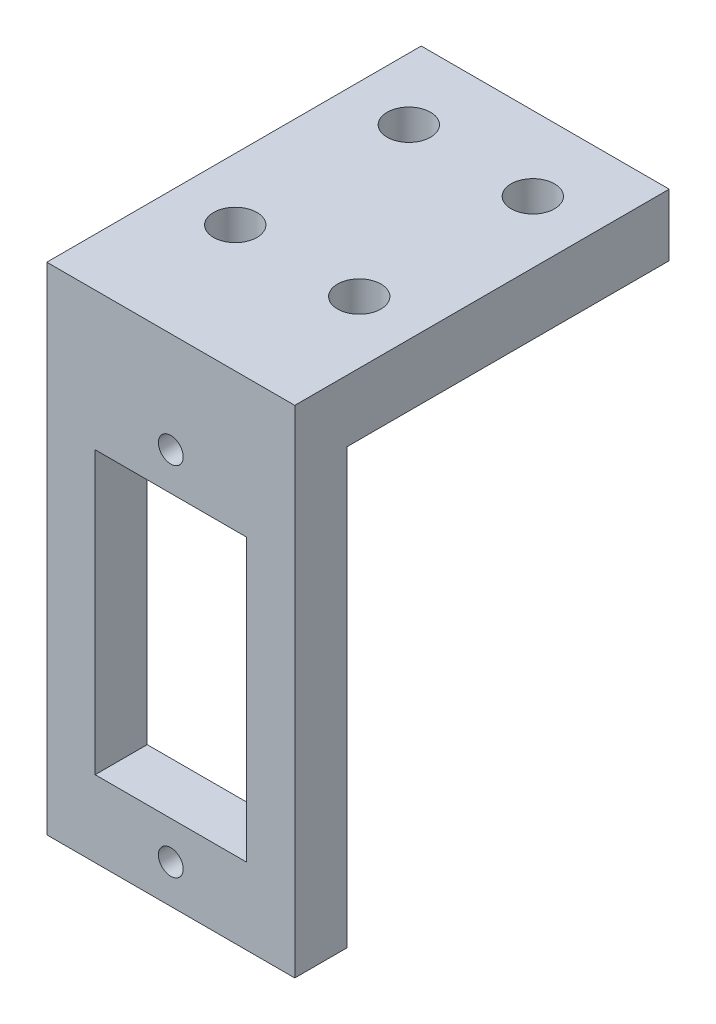
ISO-10303-21;
HEADER;
FILE_DESCRIPTION(('STEP AP214'),'2;1');
FILE_NAME('part.step','',(''),(''),'','','');
FILE_SCHEMA(('AUTOMOTIVE_DESIGN { 1 0 10303 214 1 1 1 1 }'));
ENDSEC;
DATA;
#1=APPLICATION_CONTEXT('core data for automotive mechanical design processes');
#2=APPLICATION_PROTOCOL_DEFINITION('international standard','automotive_design',2000,#1);
#3=PRODUCT_CONTEXT('',#1,'mechanical');
#4=PRODUCT('Part','Part','',(#3));
#5=PRODUCT_RELATED_PRODUCT_CATEGORY('part','',(#4));
#6=PRODUCT_DEFINITION_FORMATION('','',#4);
#7=PRODUCT_DEFINITION_CONTEXT('part definition',#1,'design');
#8=PRODUCT_DEFINITION('design','',#6,#7);
#9=PRODUCT_DEFINITION_SHAPE('','',#8);
#10=(LENGTH_UNIT() NAMED_UNIT(*) SI_UNIT(.MILLI.,.METRE.));
#11=(NAMED_UNIT(*) PLANE_ANGLE_UNIT() SI_UNIT($,.RADIAN.));
#12=(NAMED_UNIT(*) SI_UNIT($,.STERADIAN.) SOLID_ANGLE_UNIT());
#13=UNCERTAINTY_MEASURE_WITH_UNIT(LENGTH_MEASURE(1.E-05),#10,'distance_accuracy_value','');
#14=(GEOMETRIC_REPRESENTATION_CONTEXT(3) GLOBAL_UNCERTAINTY_ASSIGNED_CONTEXT((#13)) GLOBAL_UNIT_ASSIGNED_CONTEXT((#10,
#11,#12)) REPRESENTATION_CONTEXT('',''));
#15=CARTESIAN_POINT('',(0.,0.,0.));
#16=DIRECTION('',(0.,0.,1.));
#17=DIRECTION('',(1.,0.,0.));
#18=AXIS2_PLACEMENT_3D('',#15,#16,#17);
#19=CARTESIAN_POINT('',(0.,0.,0.));
#20=DIRECTION('',(0.,0.,1.));
#21=DIRECTION('',(1.,0.,0.));
#22=AXIS2_PLACEMENT_3D('',#19,#20,#21);
#23=PLANE('',#22);
#24=DIRECTION('',(1.,0.,0.));
#25=VECTOR('',#24,1.);
#26=CARTESIAN_POINT('',(6.1,11.35,0.));
#27=LINE('',#26,#25);
#28=CARTESIAN_POINT('',(-6.1,11.35,0.));
#29=VERTEX_POINT('',#28);
#30=CARTESIAN_POINT('',(6.1,11.35,0.));
#31=VERTEX_POINT('',#30);
#32=EDGE_CURVE('E213',#29,#31,#27,.T.);
#33=ORIENTED_EDGE('',*,*,#32,.F.);
#34=DIRECTION('',(0.,1.,0.));
#35=VECTOR('',#34,1.);
#36=CARTESIAN_POINT('',(-6.1,11.35,0.));
#37=LINE('',#36,#35);
#38=CARTESIAN_POINT('',(-6.1,-11.35,0.));
#39=VERTEX_POINT('',#38);
#40=EDGE_CURVE('E164',#39,#29,#37,.T.);
#41=ORIENTED_EDGE('',*,*,#40,.F.);
#42=DIRECTION('',(-1.,0.,0.));
#43=VECTOR('',#42,1.);
#44=CARTESIAN_POINT('',(6.1,-11.35,0.));
#45=LINE('',#44,#43);
#46=CARTESIAN_POINT('',(6.1,-11.35,0.));
#47=VERTEX_POINT('',#46);
#48=EDGE_CURVE('E221',#47,#39,#45,.T.);
#49=ORIENTED_EDGE('',*,*,#48,.F.);
#50=DIRECTION('',(0.,-1.,0.));
#51=VECTOR('',#50,1.);
#52=CARTESIAN_POINT('',(6.1,11.35,0.));
#53=LINE('',#52,#51);
#54=EDGE_CURVE('E217',#31,#47,#53,.T.);
#55=ORIENTED_EDGE('',*,*,#54,.F.);
#56=EDGE_LOOP('',(#33,#41,#49,#55));
#57=FACE_BOUND('',#56,.T.);
#58=CARTESIAN_POINT('',(0.,-14.3963608791062,0.));
#59=DIRECTION('',(0.,0.,1.));
#60=DIRECTION('',(1.,0.,0.));
#61=AXIS2_PLACEMENT_3D('',#58,#59,#60);
#62=CIRCLE('',#61,1.00133746946598);
#63=CARTESIAN_POINT('',(1.00133746946598,-14.3963608791062,0.));
#64=VERTEX_POINT('',#63);
#65=EDGE_CURVE('E155',#64,#64,#62,.T.);
#66=ORIENTED_EDGE('',*,*,#65,.T.);
#67=EDGE_LOOP('',(#66));
#68=FACE_BOUND('',#67,.T.);
#69=CARTESIAN_POINT('',(0.,14.4,0.));
#70=DIRECTION('',(0.,0.,1.));
#71=DIRECTION('',(1.,0.,0.));
#72=AXIS2_PLACEMENT_3D('',#69,#70,#71);
#73=CIRCLE('',#72,1.);
#74=CARTESIAN_POINT('',(1.,14.4,0.));
#75=VERTEX_POINT('',#74);
#76=EDGE_CURVE('E159',#75,#75,#73,.T.);
#77=ORIENTED_EDGE('',*,*,#76,.T.);
#78=EDGE_LOOP('',(#77));
#79=FACE_BOUND('',#78,.T.);
#80=DIRECTION('',(0.,1.,0.));
#81=VECTOR('',#80,1.);
#82=CARTESIAN_POINT('',(10.,22.5,0.));
#83=LINE('',#82,#81);
#84=CARTESIAN_POINT('',(10.,-17.5,0.));
#85=VERTEX_POINT('',#84);
#86=CARTESIAN_POINT('',(10.,17.5,0.));
#87=VERTEX_POINT('',#86);
#88=EDGE_CURVE('E64',#85,#87,#83,.T.);
#89=ORIENTED_EDGE('',*,*,#88,.F.);
#90=DIRECTION('',(-1.,0.,0.));
#91=VECTOR('',#90,1.);
#92=CARTESIAN_POINT('',(0.,-17.5,0.));
#93=LINE('',#92,#91);
#94=CARTESIAN_POINT('',(-10.,-17.5,0.));
#95=VERTEX_POINT('',#94);
#96=EDGE_CURVE('E134',#85,#95,#93,.T.);
#97=ORIENTED_EDGE('',*,*,#96,.T.);
#98=DIRECTION('',(0.,-1.,0.));
#99=VECTOR('',#98,1.);
#100=CARTESIAN_POINT('',(-10.,22.5,0.));
#101=LINE('',#100,#99);
#102=CARTESIAN_POINT('',(-10.,17.5,0.));
#103=VERTEX_POINT('',#102);
#104=EDGE_CURVE('E132',#103,#95,#101,.T.);
#105=ORIENTED_EDGE('',*,*,#104,.F.);
#106=DIRECTION('',(-1.,0.,0.));
#107=VECTOR('',#106,1.);
#108=CARTESIAN_POINT('',(10.,17.5,0.));
#109=LINE('',#108,#107);
#110=EDGE_CURVE('E180',#87,#103,#109,.T.);
#111=ORIENTED_EDGE('',*,*,#110,.F.);
#112=EDGE_LOOP('',(#89,#97,#105,#111));
#113=FACE_BOUND('',#112,.T.);
#114=ADVANCED_FACE('F39',(#57,#68,#79,#113),#23,.F.);
#115=CARTESIAN_POINT('',(10.,22.5,4.2));
#116=DIRECTION('',(-1.,0.,0.));
#117=DIRECTION('',(0.,-1.,0.));
#118=AXIS2_PLACEMENT_3D('',#115,#116,#117);
#119=PLANE('',#118);
#120=DIRECTION('',(0.,1.,0.));
#121=VECTOR('',#120,1.);
#122=CARTESIAN_POINT('',(10.,22.5,4.2));
#123=LINE('',#122,#121);
#124=CARTESIAN_POINT('',(10.,-17.5,4.2));
#125=VERTEX_POINT('',#124);
#126=CARTESIAN_POINT('',(10.,22.5,4.2));
#127=VERTEX_POINT('',#126);
#128=EDGE_CURVE('E146',#125,#127,#123,.T.);
#129=ORIENTED_EDGE('',*,*,#128,.F.);
#130=DIRECTION('',(0.,0.,1.));
#131=VECTOR('',#130,1.);
#132=CARTESIAN_POINT('',(10.,-17.5,-10.8));
#133=LINE('',#132,#131);
#134=EDGE_CURVE('E57',#85,#125,#133,.T.);
#135=ORIENTED_EDGE('',*,*,#134,.F.);
#136=ORIENTED_EDGE('',*,*,#88,.T.);
#137=DIRECTION('',(0.,0.,1.));
#138=VECTOR('',#137,1.);
#139=CARTESIAN_POINT('',(10.,17.5,-26.));
#140=LINE('',#139,#138);
#141=CARTESIAN_POINT('',(10.,17.5,-26.));
#142=VERTEX_POINT('',#141);
#143=EDGE_CURVE('E201',#142,#87,#140,.T.);
#144=ORIENTED_EDGE('',*,*,#143,.F.);
#145=DIRECTION('',(0.,-1.,0.));
#146=VECTOR('',#145,1.);
#147=CARTESIAN_POINT('',(10.,22.5,-26.));
#148=LINE('',#147,#146);
#149=CARTESIAN_POINT('',(10.,22.5,-26.));
#150=VERTEX_POINT('',#149);
#151=EDGE_CURVE('E185',#150,#142,#148,.T.);
#152=ORIENTED_EDGE('',*,*,#151,.F.);
#153=DIRECTION('',(0.,0.,-1.));
#154=VECTOR('',#153,1.);
#155=CARTESIAN_POINT('',(10.,22.5,4.2));
#156=LINE('',#155,#154);
#157=EDGE_CURVE('E11',#127,#150,#156,.T.);
#158=ORIENTED_EDGE('',*,*,#157,.F.);
#159=EDGE_LOOP('',(#129,#135,#136,#144,#152,#158));
#160=FACE_BOUND('',#159,.T.);
#161=ADVANCED_FACE('F41',(#160),#119,.F.);
#162=CARTESIAN_POINT('',(-10.,22.5,4.2));
#163=DIRECTION('',(0.,-1.,0.));
#164=DIRECTION('',(0.,0.,-1.));
#165=AXIS2_PLACEMENT_3D('',#162,#163,#164);
#166=PLANE('',#165);
#167=CARTESIAN_POINT('',(-5.,22.5,-20.));
#168=DIRECTION('',(0.,1.,0.));
#169=DIRECTION('',(0.,0.,-1.));
#170=AXIS2_PLACEMENT_3D('',#167,#168,#169);
#171=CIRCLE('',#170,1.75);
#172=CARTESIAN_POINT('',(-5.,22.5,-21.75));
#173=VERTEX_POINT('',#172);
#174=EDGE_CURVE('E270',#173,#173,#171,.T.);
#175=ORIENTED_EDGE('',*,*,#174,.F.);
#176=EDGE_LOOP('',(#175));
#177=FACE_BOUND('',#176,.T.);
#178=CARTESIAN_POINT('',(5.,22.5,-20.));
#179=DIRECTION('',(0.,1.,0.));
#180=DIRECTION('',(0.,0.,-1.));
#181=AXIS2_PLACEMENT_3D('',#178,#179,#180);
#182=CIRCLE('',#181,1.75);
#183=CARTESIAN_POINT('',(5.,22.5,-21.75));
#184=VERTEX_POINT('',#183);
#185=EDGE_CURVE('E274',#184,#184,#182,.T.);
#186=ORIENTED_EDGE('',*,*,#185,.F.);
#187=EDGE_LOOP('',(#186));
#188=FACE_BOUND('',#187,.T.);
#189=CARTESIAN_POINT('',(5.,22.5,-6.));
#190=DIRECTION('',(0.,1.,0.));
#191=DIRECTION('',(0.,0.,1.));
#192=AXIS2_PLACEMENT_3D('',#189,#190,#191);
#193=CIRCLE('',#192,1.75);
#194=CARTESIAN_POINT('',(5.,22.5,-4.25));
#195=VERTEX_POINT('',#194);
#196=EDGE_CURVE('E269',#195,#195,#193,.T.);
#197=ORIENTED_EDGE('',*,*,#196,.F.);
#198=EDGE_LOOP('',(#197));
#199=FACE_BOUND('',#198,.T.);
#200=CARTESIAN_POINT('',(-5.,22.5,-6.));
#201=DIRECTION('',(0.,1.,0.));
#202=DIRECTION('',(0.,0.,1.));
#203=AXIS2_PLACEMENT_3D('',#200,#201,#202);
#204=CIRCLE('',#203,1.75);
#205=CARTESIAN_POINT('',(-5.,22.5,-4.25));
#206=VERTEX_POINT('',#205);
#207=EDGE_CURVE('E170',#206,#206,#204,.T.);
#208=ORIENTED_EDGE('',*,*,#207,.F.);
#209=EDGE_LOOP('',(#208));
#210=FACE_BOUND('',#209,.T.);
#211=ORIENTED_EDGE('',*,*,#157,.T.);
#212=DIRECTION('',(1.,0.,0.));
#213=VECTOR('',#212,1.);
#214=CARTESIAN_POINT('',(10.,22.5,-26.));
#215=LINE('',#214,#213);
#216=CARTESIAN_POINT('',(-10.,22.5,-26.));
#217=VERTEX_POINT('',#216);
#218=EDGE_CURVE('E196',#217,#150,#215,.T.);
#219=ORIENTED_EDGE('',*,*,#218,.F.);
#220=DIRECTION('',(0.,0.,-1.));
#221=VECTOR('',#220,1.);
#222=CARTESIAN_POINT('',(-10.,22.5,4.2));
#223=LINE('',#222,#221);
#224=CARTESIAN_POINT('',(-10.,22.5,4.2));
#225=VERTEX_POINT('',#224);
#226=EDGE_CURVE('E49',#225,#217,#223,.T.);
#227=ORIENTED_EDGE('',*,*,#226,.F.);
#228=DIRECTION('',(-1.,0.,0.));
#229=VECTOR('',#228,1.);
#230=CARTESIAN_POINT('',(-10.,22.5,4.2));
#231=LINE('',#230,#229);
#232=EDGE_CURVE('E139',#127,#225,#231,.T.);
#233=ORIENTED_EDGE('',*,*,#232,.F.);
#234=EDGE_LOOP('',(#211,#219,#227,#233));
#235=FACE_BOUND('',#234,.T.);
#236=ADVANCED_FACE('F252',(#177,#188,#199,#210,#235),#166,.F.);
#237=CARTESIAN_POINT('',(-10.,22.5,4.2));
#238=DIRECTION('',(1.,0.,0.));
#239=DIRECTION('',(0.,1.,0.));
#240=AXIS2_PLACEMENT_3D('',#237,#238,#239);
#241=PLANE('',#240);
#242=ORIENTED_EDGE('',*,*,#104,.T.);
#243=DIRECTION('',(0.,0.,1.));
#244=VECTOR('',#243,1.);
#245=CARTESIAN_POINT('',(-10.,-17.5,-10.8));
#246=LINE('',#245,#244);
#247=CARTESIAN_POINT('',(-10.,-17.5,4.2));
#248=VERTEX_POINT('',#247);
#249=EDGE_CURVE('E119',#95,#248,#246,.T.);
#250=ORIENTED_EDGE('',*,*,#249,.T.);
#251=DIRECTION('',(0.,-1.,0.));
#252=VECTOR('',#251,1.);
#253=CARTESIAN_POINT('',(-10.,22.5,4.2));
#254=LINE('',#253,#252);
#255=EDGE_CURVE('E130',#225,#248,#254,.T.);
#256=ORIENTED_EDGE('',*,*,#255,.F.);
#257=ORIENTED_EDGE('',*,*,#226,.T.);
#258=DIRECTION('',(0.,1.,0.));
#259=VECTOR('',#258,1.);
#260=CARTESIAN_POINT('',(-10.,22.5,-26.));
#261=LINE('',#260,#259);
#262=CARTESIAN_POINT('',(-10.,17.5,-26.));
#263=VERTEX_POINT('',#262);
#264=EDGE_CURVE('E260',#263,#217,#261,.T.);
#265=ORIENTED_EDGE('',*,*,#264,.F.);
#266=DIRECTION('',(0.,0.,1.));
#267=VECTOR('',#266,1.);
#268=CARTESIAN_POINT('',(-10.,17.5,-26.));
#269=LINE('',#268,#267);
#270=EDGE_CURVE('E198',#263,#103,#269,.T.);
#271=ORIENTED_EDGE('',*,*,#270,.T.);
#272=EDGE_LOOP('',(#242,#250,#256,#257,#265,#271));
#273=FACE_BOUND('',#272,.T.);
#274=ADVANCED_FACE('F129',(#273),#241,.F.);
#275=CARTESIAN_POINT('',(0.,0.,4.2));
#276=DIRECTION('',(0.,0.,1.));
#277=DIRECTION('',(1.,0.,0.));
#278=AXIS2_PLACEMENT_3D('',#275,#276,#277);
#279=PLANE('',#278);
#280=DIRECTION('',(-1.,0.,0.));
#281=VECTOR('',#280,1.);
#282=CARTESIAN_POINT('',(-10.,-17.5,4.2));
#283=LINE('',#282,#281);
#284=EDGE_CURVE('E116',#125,#248,#283,.T.);
#285=ORIENTED_EDGE('',*,*,#284,.F.);
#286=ORIENTED_EDGE('',*,*,#128,.T.);
#287=ORIENTED_EDGE('',*,*,#232,.T.);
#288=ORIENTED_EDGE('',*,*,#255,.T.);
#289=EDGE_LOOP('',(#285,#286,#287,#288));
#290=FACE_BOUND('',#289,.T.);
#291=CARTESIAN_POINT('',(0.,14.4,4.2));
#292=DIRECTION('',(0.,0.,1.));
#293=DIRECTION('',(1.,0.,0.));
#294=AXIS2_PLACEMENT_3D('',#291,#292,#293);
#295=CIRCLE('',#294,1.);
#296=CARTESIAN_POINT('',(1.,14.4,4.2));
#297=VERTEX_POINT('',#296);
#298=EDGE_CURVE('E160',#297,#297,#295,.T.);
#299=ORIENTED_EDGE('',*,*,#298,.F.);
#300=EDGE_LOOP('',(#299));
#301=FACE_BOUND('',#300,.T.);
#302=CARTESIAN_POINT('',(0.,-14.3963608791062,4.2));
#303=DIRECTION('',(0.,0.,1.));
#304=DIRECTION('',(1.,0.,0.));
#305=AXIS2_PLACEMENT_3D('',#302,#303,#304);
#306=CIRCLE('',#305,1.00133746946598);
#307=CARTESIAN_POINT('',(1.00133746946598,-14.3963608791062,4.2));
#308=VERTEX_POINT('',#307);
#309=EDGE_CURVE('E204',#308,#308,#306,.T.);
#310=ORIENTED_EDGE('',*,*,#309,.F.);
#311=EDGE_LOOP('',(#310));
#312=FACE_BOUND('',#311,.T.);
#313=DIRECTION('',(0.,-1.,0.));
#314=VECTOR('',#313,1.);
#315=CARTESIAN_POINT('',(-6.1,0.,4.2));
#316=LINE('',#315,#314);
#317=CARTESIAN_POINT('',(-6.1,11.35,4.2));
#318=VERTEX_POINT('',#317);
#319=CARTESIAN_POINT('',(-6.1,-11.35,4.2));
#320=VERTEX_POINT('',#319);
#321=EDGE_CURVE('E152',#318,#320,#316,.T.);
#322=ORIENTED_EDGE('',*,*,#321,.F.);
#323=DIRECTION('',(-1.,0.,0.));
#324=VECTOR('',#323,1.);
#325=CARTESIAN_POINT('',(0.,11.35,4.2));
#326=LINE('',#325,#324);
#327=CARTESIAN_POINT('',(6.1,11.35,4.2));
#328=VERTEX_POINT('',#327);
#329=EDGE_CURVE('E229',#328,#318,#326,.T.);
#330=ORIENTED_EDGE('',*,*,#329,.F.);
#331=DIRECTION('',(0.,1.,0.));
#332=VECTOR('',#331,1.);
#333=CARTESIAN_POINT('',(6.1,0.,4.2));
#334=LINE('',#333,#332);
#335=CARTESIAN_POINT('',(6.1,-11.35,4.2));
#336=VERTEX_POINT('',#335);
#337=EDGE_CURVE('E241',#336,#328,#334,.T.);
#338=ORIENTED_EDGE('',*,*,#337,.F.);
#339=DIRECTION('',(1.,0.,0.));
#340=VECTOR('',#339,1.);
#341=CARTESIAN_POINT('',(0.,-11.35,4.2));
#342=LINE('',#341,#340);
#343=EDGE_CURVE('E245',#320,#336,#342,.T.);
#344=ORIENTED_EDGE('',*,*,#343,.F.);
#345=EDGE_LOOP('',(#322,#330,#338,#344));
#346=FACE_BOUND('',#345,.T.);
#347=ADVANCED_FACE('F136',(#290,#301,#312,#346),#279,.T.);
#348=CARTESIAN_POINT('',(-6.1,11.35,5.));
#349=DIRECTION('',(-1.,0.,0.));
#350=DIRECTION('',(0.,-1.,0.));
#351=AXIS2_PLACEMENT_3D('',#348,#349,#350);
#352=PLANE('',#351);
#353=ORIENTED_EDGE('',*,*,#321,.T.);
#354=DIRECTION('',(0.,0.,-1.));
#355=VECTOR('',#354,1.);
#356=CARTESIAN_POINT('',(-6.1,-11.35,5.));
#357=LINE('',#356,#355);
#358=EDGE_CURVE('E226',#320,#39,#357,.T.);
#359=ORIENTED_EDGE('',*,*,#358,.T.);
#360=ORIENTED_EDGE('',*,*,#40,.T.);
#361=DIRECTION('',(0.,0.,-1.));
#362=VECTOR('',#361,1.);
#363=CARTESIAN_POINT('',(-6.1,11.35,5.));
#364=LINE('',#363,#362);
#365=EDGE_CURVE('E225',#318,#29,#364,.T.);
#366=ORIENTED_EDGE('',*,*,#365,.F.);
#367=EDGE_LOOP('',(#353,#359,#360,#366));
#368=FACE_BOUND('',#367,.T.);
#369=ADVANCED_FACE('F425',(#368),#352,.F.);
#370=CARTESIAN_POINT('',(6.1,-11.35,5.));
#371=DIRECTION('',(0.,-1.,0.));
#372=DIRECTION('',(0.,0.,-1.));
#373=AXIS2_PLACEMENT_3D('',#370,#371,#372);
#374=PLANE('',#373);
#375=ORIENTED_EDGE('',*,*,#343,.T.);
#376=DIRECTION('',(0.,0.,-1.));
#377=VECTOR('',#376,1.);
#378=CARTESIAN_POINT('',(6.1,-11.35,5.));
#379=LINE('',#378,#377);
#380=EDGE_CURVE('E230',#336,#47,#379,.T.);
#381=ORIENTED_EDGE('',*,*,#380,.T.);
#382=ORIENTED_EDGE('',*,*,#48,.T.);
#383=ORIENTED_EDGE('',*,*,#358,.F.);
#384=EDGE_LOOP('',(#375,#381,#382,#383));
#385=FACE_BOUND('',#384,.T.);
#386=ADVANCED_FACE('F415',(#385),#374,.F.);
#387=CARTESIAN_POINT('',(6.1,11.35,5.));
#388=DIRECTION('',(1.,0.,0.));
#389=DIRECTION('',(0.,1.,0.));
#390=AXIS2_PLACEMENT_3D('',#387,#388,#389);
#391=PLANE('',#390);
#392=ORIENTED_EDGE('',*,*,#337,.T.);
#393=DIRECTION('',(0.,0.,-1.));
#394=VECTOR('',#393,1.);
#395=CARTESIAN_POINT('',(6.1,11.35,5.));
#396=LINE('',#395,#394);
#397=EDGE_CURVE('E233',#328,#31,#396,.T.);
#398=ORIENTED_EDGE('',*,*,#397,.T.);
#399=ORIENTED_EDGE('',*,*,#54,.T.);
#400=ORIENTED_EDGE('',*,*,#380,.F.);
#401=EDGE_LOOP('',(#392,#398,#399,#400));
#402=FACE_BOUND('',#401,.T.);
#403=ADVANCED_FACE('F405',(#402),#391,.F.);
#404=CARTESIAN_POINT('',(6.1,11.35,5.));
#405=DIRECTION('',(0.,1.,0.));
#406=DIRECTION('',(0.,0.,1.));
#407=AXIS2_PLACEMENT_3D('',#404,#405,#406);
#408=PLANE('',#407);
#409=ORIENTED_EDGE('',*,*,#329,.T.);
#410=ORIENTED_EDGE('',*,*,#365,.T.);
#411=ORIENTED_EDGE('',*,*,#32,.T.);
#412=ORIENTED_EDGE('',*,*,#397,.F.);
#413=EDGE_LOOP('',(#409,#410,#411,#412));
#414=FACE_BOUND('',#413,.T.);
#415=ADVANCED_FACE('F395',(#414),#408,.F.);
#416=CARTESIAN_POINT('',(0.,-14.3963608791062,-0.799999999999999));
#417=DIRECTION('',(0.,0.,1.));
#418=DIRECTION('',(1.,0.,0.));
#419=AXIS2_PLACEMENT_3D('',#416,#417,#418);
#420=CYLINDRICAL_SURFACE('',#419,1.00133746946598);
#421=ORIENTED_EDGE('',*,*,#309,.T.);
#422=EDGE_LOOP('',(#421));
#423=FACE_BOUND('',#422,.T.);
#424=ORIENTED_EDGE('',*,*,#65,.F.);
#425=EDGE_LOOP('',(#424));
#426=FACE_BOUND('',#425,.T.);
#427=ADVANCED_FACE('F295',(#423,#426),#420,.F.);
#428=CARTESIAN_POINT('',(0.,14.4,-0.799999999999999));
#429=DIRECTION('',(0.,0.,1.));
#430=DIRECTION('',(1.,0.,0.));
#431=AXIS2_PLACEMENT_3D('',#428,#429,#430);
#432=CYLINDRICAL_SURFACE('',#431,1.);
#433=ORIENTED_EDGE('',*,*,#298,.T.);
#434=EDGE_LOOP('',(#433));
#435=FACE_BOUND('',#434,.T.);
#436=ORIENTED_EDGE('',*,*,#76,.F.);
#437=EDGE_LOOP('',(#436));
#438=FACE_BOUND('',#437,.T.);
#439=ADVANCED_FACE('F287',(#435,#438),#432,.F.);
#440=CARTESIAN_POINT('',(10.,17.5,-26.));
#441=DIRECTION('',(0.,1.,0.));
#442=DIRECTION('',(0.,0.,1.));
#443=AXIS2_PLACEMENT_3D('',#440,#441,#442);
#444=PLANE('',#443);
#445=CARTESIAN_POINT('',(-5.,17.5,-20.));
#446=DIRECTION('',(0.,1.,0.));
#447=DIRECTION('',(0.,0.,1.));
#448=AXIS2_PLACEMENT_3D('',#445,#446,#447);
#449=CIRCLE('',#448,1.75);
#450=CARTESIAN_POINT('',(-5.,17.5,-18.25));
#451=VERTEX_POINT('',#450);
#452=EDGE_CURVE('E43',#451,#451,#449,.T.);
#453=ORIENTED_EDGE('',*,*,#452,.T.);
#454=EDGE_LOOP('',(#453));
#455=FACE_BOUND('',#454,.T.);
#456=CARTESIAN_POINT('',(5.,17.5,-20.));
#457=DIRECTION('',(0.,1.,0.));
#458=DIRECTION('',(0.,0.,1.));
#459=AXIS2_PLACEMENT_3D('',#456,#457,#458);
#460=CIRCLE('',#459,1.75);
#461=CARTESIAN_POINT('',(5.,17.5,-18.25));
#462=VERTEX_POINT('',#461);
#463=EDGE_CURVE('E173',#462,#462,#460,.T.);
#464=ORIENTED_EDGE('',*,*,#463,.T.);
#465=EDGE_LOOP('',(#464));
#466=FACE_BOUND('',#465,.T.);
#467=CARTESIAN_POINT('',(5.,17.5,-6.));
#468=DIRECTION('',(0.,1.,0.));
#469=DIRECTION('',(0.,0.,1.));
#470=AXIS2_PLACEMENT_3D('',#467,#468,#469);
#471=CIRCLE('',#470,1.75);
#472=CARTESIAN_POINT('',(5.,17.5,-4.25));
#473=VERTEX_POINT('',#472);
#474=EDGE_CURVE('E169',#473,#473,#471,.T.);
#475=ORIENTED_EDGE('',*,*,#474,.T.);
#476=EDGE_LOOP('',(#475));
#477=FACE_BOUND('',#476,.T.);
#478=CARTESIAN_POINT('',(-5.,17.5,-6.));
#479=DIRECTION('',(0.,1.,0.));
#480=DIRECTION('',(0.,0.,1.));
#481=AXIS2_PLACEMENT_3D('',#478,#479,#480);
#482=CIRCLE('',#481,1.75);
#483=CARTESIAN_POINT('',(-5.,17.5,-4.25));
#484=VERTEX_POINT('',#483);
#485=EDGE_CURVE('E165',#484,#484,#482,.T.);
#486=ORIENTED_EDGE('',*,*,#485,.T.);
#487=EDGE_LOOP('',(#486));
#488=FACE_BOUND('',#487,.T.);
#489=ORIENTED_EDGE('',*,*,#110,.T.);
#490=ORIENTED_EDGE('',*,*,#270,.F.);
#491=DIRECTION('',(-1.,0.,0.));
#492=VECTOR('',#491,1.);
#493=CARTESIAN_POINT('',(10.,17.5,-26.));
#494=LINE('',#493,#492);
#495=EDGE_CURVE('E192',#142,#263,#494,.T.);
#496=ORIENTED_EDGE('',*,*,#495,.F.);
#497=ORIENTED_EDGE('',*,*,#143,.T.);
#498=EDGE_LOOP('',(#489,#490,#496,#497));
#499=FACE_BOUND('',#498,.T.);
#500=ADVANCED_FACE('F285',(#455,#466,#477,#488,#499),#444,.F.);
#501=CARTESIAN_POINT('',(0.,0.,-26.));
#502=DIRECTION('',(0.,0.,-1.));
#503=DIRECTION('',(-1.,0.,0.));
#504=AXIS2_PLACEMENT_3D('',#501,#502,#503);
#505=PLANE('',#504);
#506=ORIENTED_EDGE('',*,*,#151,.T.);
#507=ORIENTED_EDGE('',*,*,#495,.T.);
#508=ORIENTED_EDGE('',*,*,#264,.T.);
#509=ORIENTED_EDGE('',*,*,#218,.T.);
#510=EDGE_LOOP('',(#506,#507,#508,#509));
#511=FACE_BOUND('',#510,.T.);
#512=ADVANCED_FACE('F257',(#511),#505,.T.);
#513=CARTESIAN_POINT('',(-5.,7.5,-6.));
#514=DIRECTION('',(0.,1.,0.));
#515=DIRECTION('',(0.,0.,1.));
#516=AXIS2_PLACEMENT_3D('',#513,#514,#515);
#517=CYLINDRICAL_SURFACE('',#516,1.75);
#518=ORIENTED_EDGE('',*,*,#207,.T.);
#519=EDGE_LOOP('',(#518));
#520=FACE_BOUND('',#519,.T.);
#521=ORIENTED_EDGE('',*,*,#485,.F.);
#522=EDGE_LOOP('',(#521));
#523=FACE_BOUND('',#522,.T.);
#524=ADVANCED_FACE('F293',(#520,#523),#517,.F.);
#525=CARTESIAN_POINT('',(5.,7.5,-6.));
#526=DIRECTION('',(0.,1.,0.));
#527=DIRECTION('',(0.,0.,1.));
#528=AXIS2_PLACEMENT_3D('',#525,#526,#527);
#529=CYLINDRICAL_SURFACE('',#528,1.75);
#530=ORIENTED_EDGE('',*,*,#196,.T.);
#531=EDGE_LOOP('',(#530));
#532=FACE_BOUND('',#531,.T.);
#533=ORIENTED_EDGE('',*,*,#474,.F.);
#534=EDGE_LOOP('',(#533));
#535=FACE_BOUND('',#534,.T.);
#536=ADVANCED_FACE('F324',(#532,#535),#529,.F.);
#537=CARTESIAN_POINT('',(5.,7.5,-20.));
#538=DIRECTION('',(0.,1.,0.));
#539=DIRECTION('',(0.,0.,1.));
#540=AXIS2_PLACEMENT_3D('',#537,#538,#539);
#541=CYLINDRICAL_SURFACE('',#540,1.75);
#542=ORIENTED_EDGE('',*,*,#185,.T.);
#543=EDGE_LOOP('',(#542));
#544=FACE_BOUND('',#543,.T.);
#545=ORIENTED_EDGE('',*,*,#463,.F.);
#546=EDGE_LOOP('',(#545));
#547=FACE_BOUND('',#546,.T.);
#548=ADVANCED_FACE('F331',(#544,#547),#541,.F.);
#549=CARTESIAN_POINT('',(-5.,7.5,-20.));
#550=DIRECTION('',(0.,1.,0.));
#551=DIRECTION('',(0.,0.,1.));
#552=AXIS2_PLACEMENT_3D('',#549,#550,#551);
#553=CYLINDRICAL_SURFACE('',#552,1.75);
#554=ORIENTED_EDGE('',*,*,#174,.T.);
#555=EDGE_LOOP('',(#554));
#556=FACE_BOUND('',#555,.T.);
#557=ORIENTED_EDGE('',*,*,#452,.F.);
#558=EDGE_LOOP('',(#557));
#559=FACE_BOUND('',#558,.T.);
#560=ADVANCED_FACE('F335',(#556,#559),#553,.F.);
#561=CARTESIAN_POINT('',(-10.,-17.5,-10.8));
#562=DIRECTION('',(0.,1.,0.));
#563=DIRECTION('',(0.,0.,1.));
#564=AXIS2_PLACEMENT_3D('',#561,#562,#563);
#565=PLANE('',#564);
#566=ORIENTED_EDGE('',*,*,#134,.T.);
#567=ORIENTED_EDGE('',*,*,#284,.T.);
#568=ORIENTED_EDGE('',*,*,#249,.F.);
#569=ORIENTED_EDGE('',*,*,#96,.F.);
#570=EDGE_LOOP('',(#566,#567,#568,#569));
#571=FACE_BOUND('',#570,.T.);
#572=ADVANCED_FACE('F118',(#571),#565,.F.);
#573=CLOSED_SHELL('',(#114,#161,#236,#274,#347,#369,#386,#403,#415,#427,#439,#500,#512,#524,
#536,#548,#560,#572));
#574=MANIFOLD_SOLID_BREP('B2',#573);
#575=ADVANCED_BREP_SHAPE_REPRESENTATION('',(#18,#574),#14);
#576=SHAPE_DEFINITION_REPRESENTATION(#9,#575);
ENDSEC;
END-ISO-10303-21;
